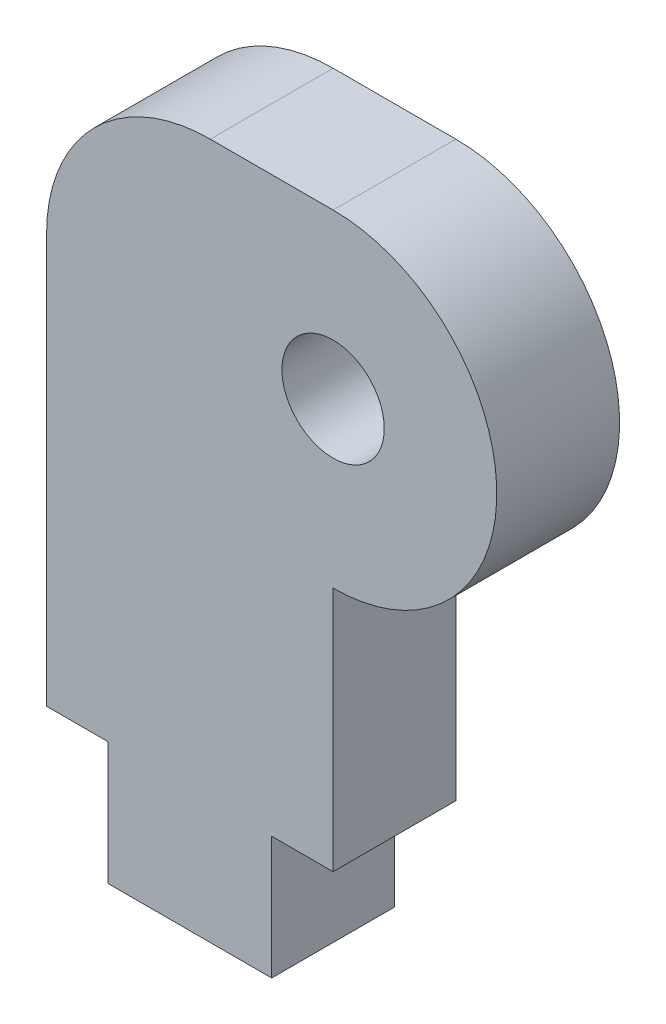
ISO-10303-21;
HEADER;
FILE_DESCRIPTION(('STEP AP214'),'2;1');
FILE_NAME('part.step','',(''),(''),'','','');
FILE_SCHEMA(('AUTOMOTIVE_DESIGN { 1 0 10303 214 1 1 1 1 }'));
ENDSEC;
DATA;
#1=APPLICATION_CONTEXT('core data for automotive mechanical design processes');
#2=APPLICATION_PROTOCOL_DEFINITION('international standard','automotive_design',2000,#1);
#3=PRODUCT_CONTEXT('',#1,'mechanical');
#4=PRODUCT('Part','Part','',(#3));
#5=PRODUCT_RELATED_PRODUCT_CATEGORY('part','',(#4));
#6=PRODUCT_DEFINITION_FORMATION('','',#4);
#7=PRODUCT_DEFINITION_CONTEXT('part definition',#1,'design');
#8=PRODUCT_DEFINITION('design','',#6,#7);
#9=PRODUCT_DEFINITION_SHAPE('','',#8);
#10=(LENGTH_UNIT() NAMED_UNIT(*) SI_UNIT(.MILLI.,.METRE.));
#11=(NAMED_UNIT(*) PLANE_ANGLE_UNIT() SI_UNIT($,.RADIAN.));
#12=(NAMED_UNIT(*) SI_UNIT($,.STERADIAN.) SOLID_ANGLE_UNIT());
#13=UNCERTAINTY_MEASURE_WITH_UNIT(LENGTH_MEASURE(1.E-05),#10,'distance_accuracy_value','');
#14=(GEOMETRIC_REPRESENTATION_CONTEXT(3) GLOBAL_UNCERTAINTY_ASSIGNED_CONTEXT((#13)) GLOBAL_UNIT_ASSIGNED_CONTEXT((#10,
#11,#12)) REPRESENTATION_CONTEXT('',''));
#15=CARTESIAN_POINT('',(0.,0.,0.));
#16=DIRECTION('',(0.,0.,1.));
#17=DIRECTION('',(1.,0.,0.));
#18=AXIS2_PLACEMENT_3D('',#15,#16,#17);
#19=CARTESIAN_POINT('',(0.,0.,3.));
#20=DIRECTION('',(0.,0.,1.));
#21=DIRECTION('',(1.,0.,0.));
#22=AXIS2_PLACEMENT_3D('',#19,#20,#21);
#23=PLANE('',#22);
#24=DIRECTION('',(-1.,0.,0.));
#25=VECTOR('',#24,1.);
#26=CARTESIAN_POINT('',(0.,4.,3.));
#27=LINE('',#26,#25);
#28=CARTESIAN_POINT('',(0.,4.,3.));
#29=VERTEX_POINT('',#28);
#30=CARTESIAN_POINT('',(-3.,4.,3.));
#31=VERTEX_POINT('',#30);
#32=EDGE_CURVE('E179',#29,#31,#27,.T.);
#33=ORIENTED_EDGE('',*,*,#32,.T.);
#34=CARTESIAN_POINT('',(-3.,0.,3.));
#35=DIRECTION('',(0.,0.,1.));
#36=DIRECTION('',(1.,0.,0.));
#37=AXIS2_PLACEMENT_3D('',#34,#35,#36);
#38=CIRCLE('',#37,4.);
#39=CARTESIAN_POINT('',(-7.,0.,3.));
#40=VERTEX_POINT('',#39);
#41=EDGE_CURVE('E11',#31,#40,#38,.T.);
#42=ORIENTED_EDGE('',*,*,#41,.T.);
#43=DIRECTION('',(0.,-1.,0.));
#44=VECTOR('',#43,1.);
#45=CARTESIAN_POINT('',(-7.,4.,3.));
#46=LINE('',#45,#44);
#47=CARTESIAN_POINT('',(-7.,-10.,3.));
#48=VERTEX_POINT('',#47);
#49=EDGE_CURVE('E128',#40,#48,#46,.T.);
#50=ORIENTED_EDGE('',*,*,#49,.T.);
#51=DIRECTION('',(1.,0.,0.));
#52=VECTOR('',#51,1.);
#53=CARTESIAN_POINT('',(-7.,-10.,3.));
#54=LINE('',#53,#52);
#55=CARTESIAN_POINT('',(-5.5,-10.,3.));
#56=VERTEX_POINT('',#55);
#57=EDGE_CURVE('E123',#48,#56,#54,.T.);
#58=ORIENTED_EDGE('',*,*,#57,.T.);
#59=DIRECTION('',(0.,-1.,0.));
#60=VECTOR('',#59,1.);
#61=CARTESIAN_POINT('',(-5.5,-10.,3.));
#62=LINE('',#61,#60);
#63=CARTESIAN_POINT('',(-5.5,-13.,3.));
#64=VERTEX_POINT('',#63);
#65=EDGE_CURVE('E112',#56,#64,#62,.T.);
#66=ORIENTED_EDGE('',*,*,#65,.T.);
#67=DIRECTION('',(1.,0.,0.));
#68=VECTOR('',#67,1.);
#69=CARTESIAN_POINT('',(-5.5,-13.,3.));
#70=LINE('',#69,#68);
#71=CARTESIAN_POINT('',(-1.5,-13.,3.));
#72=VERTEX_POINT('',#71);
#73=EDGE_CURVE('E122',#64,#72,#70,.T.);
#74=ORIENTED_EDGE('',*,*,#73,.T.);
#75=DIRECTION('',(0.,1.,0.));
#76=VECTOR('',#75,1.);
#77=CARTESIAN_POINT('',(-1.5,-13.,3.));
#78=LINE('',#77,#76);
#79=CARTESIAN_POINT('',(-1.5,-10.,3.));
#80=VERTEX_POINT('',#79);
#81=EDGE_CURVE('E187',#72,#80,#78,.T.);
#82=ORIENTED_EDGE('',*,*,#81,.T.);
#83=DIRECTION('',(1.,0.,0.));
#84=VECTOR('',#83,1.);
#85=CARTESIAN_POINT('',(-1.5,-10.,3.));
#86=LINE('',#85,#84);
#87=CARTESIAN_POINT('',(0.,-10.,3.));
#88=VERTEX_POINT('',#87);
#89=EDGE_CURVE('E185',#80,#88,#86,.T.);
#90=ORIENTED_EDGE('',*,*,#89,.T.);
#91=DIRECTION('',(0.,1.,0.));
#92=VECTOR('',#91,1.);
#93=CARTESIAN_POINT('',(0.,-10.,3.));
#94=LINE('',#93,#92);
#95=CARTESIAN_POINT('',(0.,-4.,3.));
#96=VERTEX_POINT('',#95);
#97=EDGE_CURVE('E183',#88,#96,#94,.T.);
#98=ORIENTED_EDGE('',*,*,#97,.T.);
#99=CARTESIAN_POINT('',(0.,0.,3.));
#100=DIRECTION('',(0.,0.,1.));
#101=DIRECTION('',(1.,0.,0.));
#102=AXIS2_PLACEMENT_3D('',#99,#100,#101);
#103=CIRCLE('',#102,4.);
#104=EDGE_CURVE('E181',#96,#29,#103,.T.);
#105=ORIENTED_EDGE('',*,*,#104,.T.);
#106=EDGE_LOOP('',(#33,#42,#50,#58,#66,#74,#82,#90,#98,#105));
#107=FACE_BOUND('',#106,.T.);
#108=CARTESIAN_POINT('',(0.,0.,3.));
#109=DIRECTION('',(0.,0.,1.));
#110=DIRECTION('',(1.,0.,0.));
#111=AXIS2_PLACEMENT_3D('',#108,#109,#110);
#112=CIRCLE('',#111,1.25);
#113=CARTESIAN_POINT('',(1.25,0.,3.));
#114=VERTEX_POINT('',#113);
#115=EDGE_CURVE('E177',#114,#114,#112,.T.);
#116=ORIENTED_EDGE('',*,*,#115,.F.);
#117=EDGE_LOOP('',(#116));
#118=FACE_BOUND('',#117,.T.);
#119=ADVANCED_FACE('F35',(#107,#118),#23,.T.);
#120=CARTESIAN_POINT('',(0.,0.,0.));
#121=DIRECTION('',(0.,0.,1.));
#122=DIRECTION('',(1.,0.,0.));
#123=AXIS2_PLACEMENT_3D('',#120,#121,#122);
#124=PLANE('',#123);
#125=DIRECTION('',(0.,-1.,0.));
#126=VECTOR('',#125,1.);
#127=CARTESIAN_POINT('',(-7.,4.,0.));
#128=LINE('',#127,#126);
#129=CARTESIAN_POINT('',(-7.,0.,0.));
#130=VERTEX_POINT('',#129);
#131=CARTESIAN_POINT('',(-7.,-10.,0.));
#132=VERTEX_POINT('',#131);
#133=EDGE_CURVE('E132',#130,#132,#128,.T.);
#134=ORIENTED_EDGE('',*,*,#133,.F.);
#135=CARTESIAN_POINT('',(-3.,0.,0.));
#136=DIRECTION('',(0.,0.,1.));
#137=DIRECTION('',(1.,0.,0.));
#138=AXIS2_PLACEMENT_3D('',#135,#136,#137);
#139=CIRCLE('',#138,4.);
#140=CARTESIAN_POINT('',(-3.,4.,0.));
#141=VERTEX_POINT('',#140);
#142=EDGE_CURVE('E57',#130,#141,#139,.F.);
#143=ORIENTED_EDGE('',*,*,#142,.T.);
#144=DIRECTION('',(-1.,0.,0.));
#145=VECTOR('',#144,1.);
#146=CARTESIAN_POINT('',(0.,4.,0.));
#147=LINE('',#146,#145);
#148=CARTESIAN_POINT('',(0.,4.,0.));
#149=VERTEX_POINT('',#148);
#150=EDGE_CURVE('E162',#149,#141,#147,.T.);
#151=ORIENTED_EDGE('',*,*,#150,.F.);
#152=CARTESIAN_POINT('',(0.,0.,0.));
#153=DIRECTION('',(0.,0.,1.));
#154=DIRECTION('',(1.,0.,0.));
#155=AXIS2_PLACEMENT_3D('',#152,#153,#154);
#156=CIRCLE('',#155,4.);
#157=CARTESIAN_POINT('',(0.,-4.,0.));
#158=VERTEX_POINT('',#157);
#159=EDGE_CURVE('E164',#158,#149,#156,.T.);
#160=ORIENTED_EDGE('',*,*,#159,.F.);
#161=DIRECTION('',(0.,1.,0.));
#162=VECTOR('',#161,1.);
#163=CARTESIAN_POINT('',(0.,-10.,0.));
#164=LINE('',#163,#162);
#165=CARTESIAN_POINT('',(0.,-10.,0.));
#166=VERTEX_POINT('',#165);
#167=EDGE_CURVE('E166',#166,#158,#164,.T.);
#168=ORIENTED_EDGE('',*,*,#167,.F.);
#169=DIRECTION('',(1.,0.,0.));
#170=VECTOR('',#169,1.);
#171=CARTESIAN_POINT('',(-1.5,-10.,0.));
#172=LINE('',#171,#170);
#173=CARTESIAN_POINT('',(-1.5,-10.,0.));
#174=VERTEX_POINT('',#173);
#175=EDGE_CURVE('E168',#174,#166,#172,.T.);
#176=ORIENTED_EDGE('',*,*,#175,.F.);
#177=DIRECTION('',(0.,1.,0.));
#178=VECTOR('',#177,1.);
#179=CARTESIAN_POINT('',(-1.5,-13.,0.));
#180=LINE('',#179,#178);
#181=CARTESIAN_POINT('',(-1.5,-13.,0.));
#182=VERTEX_POINT('',#181);
#183=EDGE_CURVE('E170',#182,#174,#180,.T.);
#184=ORIENTED_EDGE('',*,*,#183,.F.);
#185=DIRECTION('',(1.,0.,0.));
#186=VECTOR('',#185,1.);
#187=CARTESIAN_POINT('',(-5.5,-13.,0.));
#188=LINE('',#187,#186);
#189=CARTESIAN_POINT('',(-5.5,-13.,0.));
#190=VERTEX_POINT('',#189);
#191=EDGE_CURVE('E172',#190,#182,#188,.T.);
#192=ORIENTED_EDGE('',*,*,#191,.F.);
#193=DIRECTION('',(0.,-1.,0.));
#194=VECTOR('',#193,1.);
#195=CARTESIAN_POINT('',(-5.5,-10.,0.));
#196=LINE('',#195,#194);
#197=CARTESIAN_POINT('',(-5.5,-10.,0.));
#198=VERTEX_POINT('',#197);
#199=EDGE_CURVE('E174',#198,#190,#196,.T.);
#200=ORIENTED_EDGE('',*,*,#199,.F.);
#201=DIRECTION('',(1.,0.,0.));
#202=VECTOR('',#201,1.);
#203=CARTESIAN_POINT('',(-7.,-10.,0.));
#204=LINE('',#203,#202);
#205=EDGE_CURVE('E136',#132,#198,#204,.T.);
#206=ORIENTED_EDGE('',*,*,#205,.F.);
#207=EDGE_LOOP('',(#134,#143,#151,#160,#168,#176,#184,#192,#200,#206));
#208=FACE_BOUND('',#207,.T.);
#209=CARTESIAN_POINT('',(0.,0.,0.));
#210=DIRECTION('',(0.,0.,1.));
#211=DIRECTION('',(1.,0.,0.));
#212=AXIS2_PLACEMENT_3D('',#209,#210,#211);
#213=CIRCLE('',#212,1.25);
#214=CARTESIAN_POINT('',(1.25,0.,0.));
#215=VERTEX_POINT('',#214);
#216=EDGE_CURVE('E190',#215,#215,#213,.T.);
#217=ORIENTED_EDGE('',*,*,#216,.T.);
#218=EDGE_LOOP('',(#217));
#219=FACE_BOUND('',#218,.T.);
#220=ADVANCED_FACE('F199',(#208,#219),#124,.F.);
#221=CARTESIAN_POINT('',(-7.,-10.,3.));
#222=DIRECTION('',(0.,1.,0.));
#223=DIRECTION('',(0.,0.,1.));
#224=AXIS2_PLACEMENT_3D('',#221,#222,#223);
#225=PLANE('',#224);
#226=ORIENTED_EDGE('',*,*,#205,.T.);
#227=DIRECTION('',(0.,0.,-1.));
#228=VECTOR('',#227,1.);
#229=CARTESIAN_POINT('',(-5.5,-10.,3.));
#230=LINE('',#229,#228);
#231=EDGE_CURVE('E116',#56,#198,#230,.T.);
#232=ORIENTED_EDGE('',*,*,#231,.F.);
#233=ORIENTED_EDGE('',*,*,#57,.F.);
#234=DIRECTION('',(0.,0.,-1.));
#235=VECTOR('',#234,1.);
#236=CARTESIAN_POINT('',(-7.,-10.,3.));
#237=LINE('',#236,#235);
#238=EDGE_CURVE('E159',#48,#132,#237,.T.);
#239=ORIENTED_EDGE('',*,*,#238,.T.);
#240=EDGE_LOOP('',(#226,#232,#233,#239));
#241=FACE_BOUND('',#240,.T.);
#242=ADVANCED_FACE('F134',(#241),#225,.F.);
#243=CARTESIAN_POINT('',(-5.5,-10.,3.));
#244=DIRECTION('',(1.,0.,0.));
#245=DIRECTION('',(0.,0.,-1.));
#246=AXIS2_PLACEMENT_3D('',#243,#244,#245);
#247=PLANE('',#246);
#248=ORIENTED_EDGE('',*,*,#199,.T.);
#249=DIRECTION('',(0.,0.,-1.));
#250=VECTOR('',#249,1.);
#251=CARTESIAN_POINT('',(-5.5,-13.,3.));
#252=LINE('',#251,#250);
#253=EDGE_CURVE('E119',#64,#190,#252,.T.);
#254=ORIENTED_EDGE('',*,*,#253,.F.);
#255=ORIENTED_EDGE('',*,*,#65,.F.);
#256=ORIENTED_EDGE('',*,*,#231,.T.);
#257=EDGE_LOOP('',(#248,#254,#255,#256));
#258=FACE_BOUND('',#257,.T.);
#259=ADVANCED_FACE('F114',(#258),#247,.F.);
#260=CARTESIAN_POINT('',(-5.5,-13.,3.));
#261=DIRECTION('',(0.,1.,0.));
#262=DIRECTION('',(0.,0.,1.));
#263=AXIS2_PLACEMENT_3D('',#260,#261,#262);
#264=PLANE('',#263);
#265=ORIENTED_EDGE('',*,*,#191,.T.);
#266=DIRECTION('',(0.,0.,-1.));
#267=VECTOR('',#266,1.);
#268=CARTESIAN_POINT('',(-1.5,-13.,3.));
#269=LINE('',#268,#267);
#270=EDGE_CURVE('E141',#72,#182,#269,.T.);
#271=ORIENTED_EDGE('',*,*,#270,.F.);
#272=ORIENTED_EDGE('',*,*,#73,.F.);
#273=ORIENTED_EDGE('',*,*,#253,.T.);
#274=EDGE_LOOP('',(#265,#271,#272,#273));
#275=FACE_BOUND('',#274,.T.);
#276=ADVANCED_FACE('F229',(#275),#264,.F.);
#277=CARTESIAN_POINT('',(-1.5,-13.,3.));
#278=DIRECTION('',(-1.,0.,0.));
#279=DIRECTION('',(0.,0.,1.));
#280=AXIS2_PLACEMENT_3D('',#277,#278,#279);
#281=PLANE('',#280);
#282=ORIENTED_EDGE('',*,*,#183,.T.);
#283=DIRECTION('',(0.,0.,-1.));
#284=VECTOR('',#283,1.);
#285=CARTESIAN_POINT('',(-1.5,-10.,3.));
#286=LINE('',#285,#284);
#287=EDGE_CURVE('E147',#80,#174,#286,.T.);
#288=ORIENTED_EDGE('',*,*,#287,.F.);
#289=ORIENTED_EDGE('',*,*,#81,.F.);
#290=ORIENTED_EDGE('',*,*,#270,.T.);
#291=EDGE_LOOP('',(#282,#288,#289,#290));
#292=FACE_BOUND('',#291,.T.);
#293=ADVANCED_FACE('F225',(#292),#281,.F.);
#294=CARTESIAN_POINT('',(-1.5,-10.,3.));
#295=DIRECTION('',(0.,1.,0.));
#296=DIRECTION('',(0.,0.,1.));
#297=AXIS2_PLACEMENT_3D('',#294,#295,#296);
#298=PLANE('',#297);
#299=ORIENTED_EDGE('',*,*,#175,.T.);
#300=DIRECTION('',(0.,0.,-1.));
#301=VECTOR('',#300,1.);
#302=CARTESIAN_POINT('',(0.,-10.,3.));
#303=LINE('',#302,#301);
#304=EDGE_CURVE('E150',#88,#166,#303,.T.);
#305=ORIENTED_EDGE('',*,*,#304,.F.);
#306=ORIENTED_EDGE('',*,*,#89,.F.);
#307=ORIENTED_EDGE('',*,*,#287,.T.);
#308=EDGE_LOOP('',(#299,#305,#306,#307));
#309=FACE_BOUND('',#308,.T.);
#310=ADVANCED_FACE('F221',(#309),#298,.F.);
#311=CARTESIAN_POINT('',(0.,-10.,3.));
#312=DIRECTION('',(-1.,0.,0.));
#313=DIRECTION('',(0.,-1.,0.));
#314=AXIS2_PLACEMENT_3D('',#311,#312,#313);
#315=PLANE('',#314);
#316=ORIENTED_EDGE('',*,*,#167,.T.);
#317=DIRECTION('',(0.,0.,-1.));
#318=VECTOR('',#317,1.);
#319=CARTESIAN_POINT('',(0.,-4.,3.));
#320=LINE('',#319,#318);
#321=EDGE_CURVE('E153',#96,#158,#320,.T.);
#322=ORIENTED_EDGE('',*,*,#321,.F.);
#323=ORIENTED_EDGE('',*,*,#97,.F.);
#324=ORIENTED_EDGE('',*,*,#304,.T.);
#325=EDGE_LOOP('',(#316,#322,#323,#324));
#326=FACE_BOUND('',#325,.T.);
#327=ADVANCED_FACE('F217',(#326),#315,.F.);
#328=CARTESIAN_POINT('',(0.,0.,3.));
#329=DIRECTION('',(0.,0.,-1.));
#330=DIRECTION('',(-1.,0.,0.));
#331=AXIS2_PLACEMENT_3D('',#328,#329,#330);
#332=CYLINDRICAL_SURFACE('',#331,4.);
#333=ORIENTED_EDGE('',*,*,#159,.T.);
#334=DIRECTION('',(0.,0.,-1.));
#335=VECTOR('',#334,1.);
#336=CARTESIAN_POINT('',(0.,4.,3.));
#337=LINE('',#336,#335);
#338=EDGE_CURVE('E156',#29,#149,#337,.T.);
#339=ORIENTED_EDGE('',*,*,#338,.F.);
#340=ORIENTED_EDGE('',*,*,#104,.F.);
#341=ORIENTED_EDGE('',*,*,#321,.T.);
#342=EDGE_LOOP('',(#333,#339,#340,#341));
#343=FACE_BOUND('',#342,.T.);
#344=ADVANCED_FACE('F214',(#343),#332,.T.);
#345=CARTESIAN_POINT('',(0.,4.,3.));
#346=DIRECTION('',(0.,-1.,0.));
#347=DIRECTION('',(1.,0.,0.));
#348=AXIS2_PLACEMENT_3D('',#345,#346,#347);
#349=PLANE('',#348);
#350=ORIENTED_EDGE('',*,*,#150,.T.);
#351=DIRECTION('',(0.,0.,-1.));
#352=VECTOR('',#351,1.);
#353=CARTESIAN_POINT('',(-3.,4.,3.));
#354=LINE('',#353,#352);
#355=EDGE_CURVE('E43',#141,#31,#354,.F.);
#356=ORIENTED_EDGE('',*,*,#355,.T.);
#357=ORIENTED_EDGE('',*,*,#32,.F.);
#358=ORIENTED_EDGE('',*,*,#338,.T.);
#359=EDGE_LOOP('',(#350,#356,#357,#358));
#360=FACE_BOUND('',#359,.T.);
#361=ADVANCED_FACE('F210',(#360),#349,.F.);
#362=CARTESIAN_POINT('',(-7.,4.,3.));
#363=DIRECTION('',(1.,0.,0.));
#364=DIRECTION('',(0.,1.,0.));
#365=AXIS2_PLACEMENT_3D('',#362,#363,#364);
#366=PLANE('',#365);
#367=ORIENTED_EDGE('',*,*,#49,.F.);
#368=DIRECTION('',(0.,0.,-1.));
#369=VECTOR('',#368,1.);
#370=CARTESIAN_POINT('',(-7.,0.,3.));
#371=LINE('',#370,#369);
#372=EDGE_CURVE('E137',#40,#130,#371,.T.);
#373=ORIENTED_EDGE('',*,*,#372,.T.);
#374=ORIENTED_EDGE('',*,*,#133,.T.);
#375=ORIENTED_EDGE('',*,*,#238,.F.);
#376=EDGE_LOOP('',(#367,#373,#374,#375));
#377=FACE_BOUND('',#376,.T.);
#378=ADVANCED_FACE('F207',(#377),#366,.F.);
#379=CARTESIAN_POINT('',(0.,0.,3.));
#380=DIRECTION('',(0.,0.,-1.));
#381=DIRECTION('',(-1.,0.,0.));
#382=AXIS2_PLACEMENT_3D('',#379,#380,#381);
#383=CYLINDRICAL_SURFACE('',#382,1.25);
#384=ORIENTED_EDGE('',*,*,#115,.T.);
#385=EDGE_LOOP('',(#384));
#386=FACE_BOUND('',#385,.T.);
#387=ORIENTED_EDGE('',*,*,#216,.F.);
#388=EDGE_LOOP('',(#387));
#389=FACE_BOUND('',#388,.T.);
#390=ADVANCED_FACE('F196',(#386,#389),#383,.F.);
#391=CARTESIAN_POINT('',(-3.,0.,3.));
#392=DIRECTION('',(0.,0.,-1.));
#393=DIRECTION('',(-1.,0.,0.));
#394=AXIS2_PLACEMENT_3D('',#391,#392,#393);
#395=CYLINDRICAL_SURFACE('',#394,4.);
#396=ORIENTED_EDGE('',*,*,#41,.F.);
#397=ORIENTED_EDGE('',*,*,#355,.F.);
#398=ORIENTED_EDGE('',*,*,#142,.F.);
#399=ORIENTED_EDGE('',*,*,#372,.F.);
#400=EDGE_LOOP('',(#396,#397,#398,#399));
#401=FACE_BOUND('',#400,.T.);
#402=ADVANCED_FACE('F37',(#401),#395,.T.);
#403=CLOSED_SHELL('',(#119,#220,#242,#259,#276,#293,#310,#327,#344,#361,#378,#390,#402));
#404=MANIFOLD_SOLID_BREP('B2',#403);
#405=ADVANCED_BREP_SHAPE_REPRESENTATION('',(#18,#404),#14);
#406=SHAPE_DEFINITION_REPRESENTATION(#9,#405);
ENDSEC;
END-ISO-10303-21;
